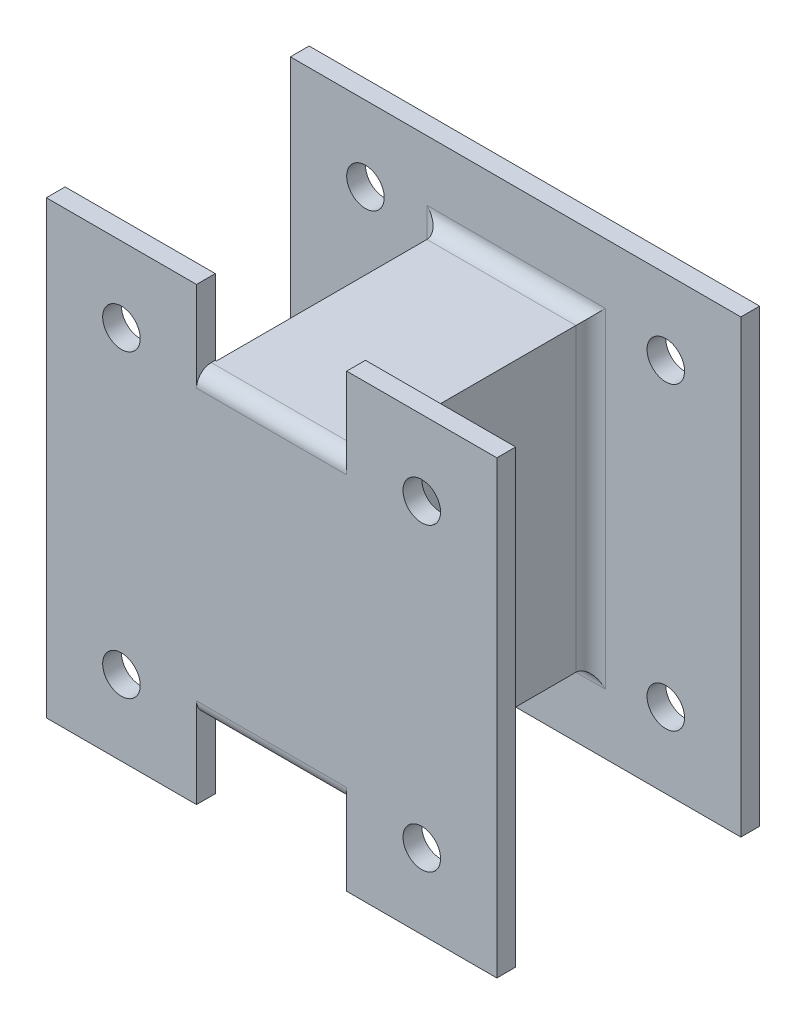
ISO-10303-21;
HEADER;
FILE_DESCRIPTION(('STEP AP214'),'2;1');
FILE_NAME('part.step','',(''),(''),'','','');
FILE_SCHEMA(('AUTOMOTIVE_DESIGN { 1 0 10303 214 1 1 1 1 }'));
ENDSEC;
DATA;
#1=APPLICATION_CONTEXT('core data for automotive mechanical design processes');
#2=APPLICATION_PROTOCOL_DEFINITION('international standard','automotive_design',2000,#1);
#3=PRODUCT_CONTEXT('',#1,'mechanical');
#4=PRODUCT('Part','Part','',(#3));
#5=PRODUCT_RELATED_PRODUCT_CATEGORY('part','',(#4));
#6=PRODUCT_DEFINITION_FORMATION('','',#4);
#7=PRODUCT_DEFINITION_CONTEXT('part definition',#1,'design');
#8=PRODUCT_DEFINITION('design','',#6,#7);
#9=PRODUCT_DEFINITION_SHAPE('','',#8);
#10=(LENGTH_UNIT() NAMED_UNIT(*) SI_UNIT(.MILLI.,.METRE.));
#11=(NAMED_UNIT(*) PLANE_ANGLE_UNIT() SI_UNIT($,.RADIAN.));
#12=(NAMED_UNIT(*) SI_UNIT($,.STERADIAN.) SOLID_ANGLE_UNIT());
#13=UNCERTAINTY_MEASURE_WITH_UNIT(LENGTH_MEASURE(1.E-05),#10,'distance_accuracy_value','');
#14=(GEOMETRIC_REPRESENTATION_CONTEXT(3) GLOBAL_UNCERTAINTY_ASSIGNED_CONTEXT((#13)) GLOBAL_UNIT_ASSIGNED_CONTEXT((#10,
#11,#12)) REPRESENTATION_CONTEXT('',''));
#15=CARTESIAN_POINT('',(0.,0.,0.));
#16=DIRECTION('',(0.,0.,1.));
#17=DIRECTION('',(1.,0.,0.));
#18=AXIS2_PLACEMENT_3D('',#15,#16,#17);
#19=CARTESIAN_POINT('',(0.,0.,6.35));
#20=DIRECTION('',(0.,0.,-1.));
#21=DIRECTION('',(-1.,0.,0.));
#22=AXIS2_PLACEMENT_3D('',#19,#20,#21);
#23=PLANE('',#22);
#24=DIRECTION('',(1.,0.,0.));
#25=VECTOR('',#24,1.);
#26=CARTESIAN_POINT('',(51.2,20.4,6.35));
#27=LINE('',#26,#25);
#28=CARTESIAN_POINT('',(106.6,20.4,6.35));
#29=VERTEX_POINT('',#28);
#30=CARTESIAN_POINT('',(46.2,20.4,6.35));
#31=VERTEX_POINT('',#30);
#32=EDGE_CURVE('E340',#29,#31,#27,.F.);
#33=ORIENTED_EDGE('',*,*,#32,.T.);
#34=DIRECTION('',(0.,-1.,0.));
#35=VECTOR('',#34,1.);
#36=CARTESIAN_POINT('',(46.2,127.,6.35));
#37=LINE('',#36,#35);
#38=CARTESIAN_POINT('',(46.2,132.,6.35));
#39=VERTEX_POINT('',#38);
#40=EDGE_CURVE('E343',#31,#39,#37,.F.);
#41=ORIENTED_EDGE('',*,*,#40,.T.);
#42=DIRECTION('',(1.,0.,0.));
#43=VECTOR('',#42,1.);
#44=CARTESIAN_POINT('',(0.,132.,6.35));
#45=LINE('',#44,#43);
#46=CARTESIAN_POINT('',(106.6,132.,6.35));
#47=VERTEX_POINT('',#46);
#48=EDGE_CURVE('E334',#39,#47,#45,.T.);
#49=ORIENTED_EDGE('',*,*,#48,.T.);
#50=DIRECTION('',(0.,-1.,0.));
#51=VECTOR('',#50,1.);
#52=CARTESIAN_POINT('',(106.6,0.,6.35));
#53=LINE('',#52,#51);
#54=EDGE_CURVE('E337',#47,#29,#53,.T.);
#55=ORIENTED_EDGE('',*,*,#54,.T.);
#56=EDGE_LOOP('',(#33,#41,#49,#55));
#57=FACE_BOUND('',#56,.T.);
#58=CARTESIAN_POINT('',(25.4000000000011,25.4,6.35));
#59=DIRECTION('',(0.,0.,1.));
#60=DIRECTION('',(1.,0.,0.));
#61=AXIS2_PLACEMENT_3D('',#58,#59,#60);
#62=CIRCLE('',#61,6.35);
#63=CARTESIAN_POINT('',(31.7500000000011,25.4,6.35));
#64=VERTEX_POINT('',#63);
#65=EDGE_CURVE('E257',#64,#64,#62,.T.);
#66=ORIENTED_EDGE('',*,*,#65,.F.);
#67=EDGE_LOOP('',(#66));
#68=FACE_BOUND('',#67,.T.);
#69=CARTESIAN_POINT('',(127.000000000001,25.4000000000014,6.35));
#70=DIRECTION('',(0.,0.,1.));
#71=DIRECTION('',(1.,0.,0.));
#72=AXIS2_PLACEMENT_3D('',#69,#70,#71);
#73=CIRCLE('',#72,6.34999999999999);
#74=CARTESIAN_POINT('',(133.350000000001,25.4000000000014,6.35));
#75=VERTEX_POINT('',#74);
#76=EDGE_CURVE('E265',#75,#75,#73,.T.);
#77=ORIENTED_EDGE('',*,*,#76,.F.);
#78=EDGE_LOOP('',(#77));
#79=FACE_BOUND('',#78,.T.);
#80=CARTESIAN_POINT('',(127.,127.000000000001,6.35));
#81=DIRECTION('',(0.,0.,1.));
#82=DIRECTION('',(1.,0.,0.));
#83=AXIS2_PLACEMENT_3D('',#80,#81,#82);
#84=CIRCLE('',#83,6.34999999999999);
#85=CARTESIAN_POINT('',(133.35,127.000000000001,6.35));
#86=VERTEX_POINT('',#85);
#87=EDGE_CURVE('E273',#86,#86,#84,.T.);
#88=ORIENTED_EDGE('',*,*,#87,.F.);
#89=EDGE_LOOP('',(#88));
#90=FACE_BOUND('',#89,.T.);
#91=CARTESIAN_POINT('',(25.4,127.,6.35));
#92=DIRECTION('',(0.,0.,1.));
#93=DIRECTION('',(1.,0.,0.));
#94=AXIS2_PLACEMENT_3D('',#91,#92,#93);
#95=CIRCLE('',#94,6.35);
#96=CARTESIAN_POINT('',(31.75,127.,6.35));
#97=VERTEX_POINT('',#96);
#98=EDGE_CURVE('E281',#97,#97,#95,.T.);
#99=ORIENTED_EDGE('',*,*,#98,.F.);
#100=EDGE_LOOP('',(#99));
#101=FACE_BOUND('',#100,.T.);
#102=DIRECTION('',(0.,-1.,0.));
#103=VECTOR('',#102,1.);
#104=CARTESIAN_POINT('',(0.,0.,6.35));
#105=LINE('',#104,#103);
#106=CARTESIAN_POINT('',(0.,152.4,6.35));
#107=VERTEX_POINT('',#106);
#108=CARTESIAN_POINT('',(0.,0.,6.35));
#109=VERTEX_POINT('',#108);
#110=EDGE_CURVE('E289',#107,#109,#105,.T.);
#111=ORIENTED_EDGE('',*,*,#110,.T.);
#112=DIRECTION('',(1.,0.,0.));
#113=VECTOR('',#112,1.);
#114=CARTESIAN_POINT('',(0.,0.,6.35));
#115=LINE('',#114,#113);
#116=CARTESIAN_POINT('',(152.4,0.,6.35));
#117=VERTEX_POINT('',#116);
#118=EDGE_CURVE('E293',#109,#117,#115,.T.);
#119=ORIENTED_EDGE('',*,*,#118,.T.);
#120=DIRECTION('',(0.,1.,0.));
#121=VECTOR('',#120,1.);
#122=CARTESIAN_POINT('',(152.4,0.,6.35));
#123=LINE('',#122,#121);
#124=CARTESIAN_POINT('',(152.4,152.4,6.35));
#125=VERTEX_POINT('',#124);
#126=EDGE_CURVE('E297',#117,#125,#123,.T.);
#127=ORIENTED_EDGE('',*,*,#126,.T.);
#128=DIRECTION('',(-1.,0.,0.));
#129=VECTOR('',#128,1.);
#130=CARTESIAN_POINT('',(0.,152.4,6.35));
#131=LINE('',#130,#129);
#132=EDGE_CURVE('E300',#125,#107,#131,.T.);
#133=ORIENTED_EDGE('',*,*,#132,.T.);
#134=EDGE_LOOP('',(#111,#119,#127,#133));
#135=FACE_BOUND('',#134,.T.);
#136=ADVANCED_FACE('F41',(#57,#68,#79,#90,#101,#135),#23,.F.);
#137=CARTESIAN_POINT('',(0.,0.,0.));
#138=DIRECTION('',(0.,0.,-1.));
#139=DIRECTION('',(-1.,0.,0.));
#140=AXIS2_PLACEMENT_3D('',#137,#138,#139);
#141=PLANE('',#140);
#142=CARTESIAN_POINT('',(127.000000000001,25.4000000000014,0.));
#143=DIRECTION('',(0.,0.,1.));
#144=DIRECTION('',(1.,0.,0.));
#145=AXIS2_PLACEMENT_3D('',#142,#143,#144);
#146=CIRCLE('',#145,6.34999999999999);
#147=CARTESIAN_POINT('',(133.350000000001,25.4000000000014,0.));
#148=VERTEX_POINT('',#147);
#149=EDGE_CURVE('E261',#148,#148,#146,.T.);
#150=ORIENTED_EDGE('',*,*,#149,.T.);
#151=EDGE_LOOP('',(#150));
#152=FACE_BOUND('',#151,.T.);
#153=CARTESIAN_POINT('',(25.4,127.,0.));
#154=DIRECTION('',(0.,0.,1.));
#155=DIRECTION('',(1.,0.,0.));
#156=AXIS2_PLACEMENT_3D('',#153,#154,#155);
#157=CIRCLE('',#156,6.35);
#158=CARTESIAN_POINT('',(31.75,127.,0.));
#159=VERTEX_POINT('',#158);
#160=EDGE_CURVE('E277',#159,#159,#157,.T.);
#161=ORIENTED_EDGE('',*,*,#160,.T.);
#162=EDGE_LOOP('',(#161));
#163=FACE_BOUND('',#162,.T.);
#164=DIRECTION('',(0.,-1.,0.));
#165=VECTOR('',#164,1.);
#166=CARTESIAN_POINT('',(0.,0.,0.));
#167=LINE('',#166,#165);
#168=CARTESIAN_POINT('',(0.,152.4,0.));
#169=VERTEX_POINT('',#168);
#170=CARTESIAN_POINT('',(0.,0.,0.));
#171=VERTEX_POINT('',#170);
#172=EDGE_CURVE('E285',#169,#171,#167,.T.);
#173=ORIENTED_EDGE('',*,*,#172,.F.);
#174=DIRECTION('',(-1.,0.,0.));
#175=VECTOR('',#174,1.);
#176=CARTESIAN_POINT('',(0.,152.4,0.));
#177=LINE('',#176,#175);
#178=CARTESIAN_POINT('',(152.4,152.4,0.));
#179=VERTEX_POINT('',#178);
#180=EDGE_CURVE('E294',#179,#169,#177,.T.);
#181=ORIENTED_EDGE('',*,*,#180,.F.);
#182=DIRECTION('',(0.,1.,0.));
#183=VECTOR('',#182,1.);
#184=CARTESIAN_POINT('',(152.4,0.,0.));
#185=LINE('',#184,#183);
#186=CARTESIAN_POINT('',(152.4,0.,0.));
#187=VERTEX_POINT('',#186);
#188=EDGE_CURVE('E310',#187,#179,#185,.T.);
#189=ORIENTED_EDGE('',*,*,#188,.F.);
#190=DIRECTION('',(1.,0.,0.));
#191=VECTOR('',#190,1.);
#192=CARTESIAN_POINT('',(0.,0.,0.));
#193=LINE('',#192,#191);
#194=EDGE_CURVE('E307',#171,#187,#193,.T.);
#195=ORIENTED_EDGE('',*,*,#194,.F.);
#196=EDGE_LOOP('',(#173,#181,#189,#195));
#197=FACE_BOUND('',#196,.T.);
#198=CARTESIAN_POINT('',(127.,127.000000000001,0.));
#199=DIRECTION('',(0.,0.,1.));
#200=DIRECTION('',(1.,0.,0.));
#201=AXIS2_PLACEMENT_3D('',#198,#199,#200);
#202=CIRCLE('',#201,6.34999999999999);
#203=CARTESIAN_POINT('',(133.35,127.000000000001,0.));
#204=VERTEX_POINT('',#203);
#205=EDGE_CURVE('E269',#204,#204,#202,.T.);
#206=ORIENTED_EDGE('',*,*,#205,.T.);
#207=EDGE_LOOP('',(#206));
#208=FACE_BOUND('',#207,.T.);
#209=CARTESIAN_POINT('',(25.4000000000011,25.4,0.));
#210=DIRECTION('',(0.,0.,1.));
#211=DIRECTION('',(1.,0.,0.));
#212=AXIS2_PLACEMENT_3D('',#209,#210,#211);
#213=CIRCLE('',#212,6.35);
#214=CARTESIAN_POINT('',(31.7500000000011,25.4,0.));
#215=VERTEX_POINT('',#214);
#216=EDGE_CURVE('E256',#215,#215,#213,.T.);
#217=ORIENTED_EDGE('',*,*,#216,.T.);
#218=EDGE_LOOP('',(#217));
#219=FACE_BOUND('',#218,.T.);
#220=ADVANCED_FACE('F569',(#152,#163,#197,#208,#219),#141,.T.);
#221=CARTESIAN_POINT('',(0.,0.,6.35));
#222=DIRECTION('',(1.,0.,0.));
#223=DIRECTION('',(0.,0.,-1.));
#224=AXIS2_PLACEMENT_3D('',#221,#222,#223);
#225=PLANE('',#224);
#226=ORIENTED_EDGE('',*,*,#172,.T.);
#227=DIRECTION('',(0.,0.,-1.));
#228=VECTOR('',#227,1.);
#229=CARTESIAN_POINT('',(0.,0.,6.35));
#230=LINE('',#229,#228);
#231=EDGE_CURVE('E326',#109,#171,#230,.T.);
#232=ORIENTED_EDGE('',*,*,#231,.F.);
#233=ORIENTED_EDGE('',*,*,#110,.F.);
#234=DIRECTION('',(0.,0.,-1.));
#235=VECTOR('',#234,1.);
#236=CARTESIAN_POINT('',(0.,152.4,6.35));
#237=LINE('',#236,#235);
#238=EDGE_CURVE('E303',#107,#169,#237,.T.);
#239=ORIENTED_EDGE('',*,*,#238,.T.);
#240=EDGE_LOOP('',(#226,#232,#233,#239));
#241=FACE_BOUND('',#240,.T.);
#242=ADVANCED_FACE('F574',(#241),#225,.F.);
#243=CARTESIAN_POINT('',(0.,0.,6.35));
#244=DIRECTION('',(0.,1.,0.));
#245=DIRECTION('',(0.,0.,1.));
#246=AXIS2_PLACEMENT_3D('',#243,#244,#245);
#247=PLANE('',#246);
#248=ORIENTED_EDGE('',*,*,#194,.T.);
#249=DIRECTION('',(0.,0.,-1.));
#250=VECTOR('',#249,1.);
#251=CARTESIAN_POINT('',(152.4,0.,6.35));
#252=LINE('',#251,#250);
#253=EDGE_CURVE('E322',#117,#187,#252,.T.);
#254=ORIENTED_EDGE('',*,*,#253,.F.);
#255=ORIENTED_EDGE('',*,*,#118,.F.);
#256=ORIENTED_EDGE('',*,*,#231,.T.);
#257=EDGE_LOOP('',(#248,#254,#255,#256));
#258=FACE_BOUND('',#257,.T.);
#259=ADVANCED_FACE('F588',(#258),#247,.F.);
#260=CARTESIAN_POINT('',(152.4,0.,6.35));
#261=DIRECTION('',(-1.,0.,0.));
#262=DIRECTION('',(0.,0.,1.));
#263=AXIS2_PLACEMENT_3D('',#260,#261,#262);
#264=PLANE('',#263);
#265=ORIENTED_EDGE('',*,*,#188,.T.);
#266=DIRECTION('',(0.,0.,-1.));
#267=VECTOR('',#266,1.);
#268=CARTESIAN_POINT('',(152.4,152.4,6.35));
#269=LINE('',#268,#267);
#270=EDGE_CURVE('E318',#125,#179,#269,.T.);
#271=ORIENTED_EDGE('',*,*,#270,.F.);
#272=ORIENTED_EDGE('',*,*,#126,.F.);
#273=ORIENTED_EDGE('',*,*,#253,.T.);
#274=EDGE_LOOP('',(#265,#271,#272,#273));
#275=FACE_BOUND('',#274,.T.);
#276=ADVANCED_FACE('F584',(#275),#264,.F.);
#277=CARTESIAN_POINT('',(0.,152.4,6.35));
#278=DIRECTION('',(0.,-1.,0.));
#279=DIRECTION('',(0.,0.,-1.));
#280=AXIS2_PLACEMENT_3D('',#277,#278,#279);
#281=PLANE('',#280);
#282=ORIENTED_EDGE('',*,*,#180,.T.);
#283=ORIENTED_EDGE('',*,*,#238,.F.);
#284=ORIENTED_EDGE('',*,*,#132,.F.);
#285=ORIENTED_EDGE('',*,*,#270,.T.);
#286=EDGE_LOOP('',(#282,#283,#284,#285));
#287=FACE_BOUND('',#286,.T.);
#288=ADVANCED_FACE('F581',(#287),#281,.F.);
#289=CARTESIAN_POINT('',(25.4,127.,6.35));
#290=DIRECTION('',(0.,0.,-1.));
#291=DIRECTION('',(-1.,0.,0.));
#292=AXIS2_PLACEMENT_3D('',#289,#290,#291);
#293=CYLINDRICAL_SURFACE('',#292,6.35);
#294=ORIENTED_EDGE('',*,*,#98,.T.);
#295=EDGE_LOOP('',(#294));
#296=FACE_BOUND('',#295,.T.);
#297=ORIENTED_EDGE('',*,*,#160,.F.);
#298=EDGE_LOOP('',(#297));
#299=FACE_BOUND('',#298,.T.);
#300=ADVANCED_FACE('F578',(#296,#299),#293,.F.);
#301=CARTESIAN_POINT('',(127.,127.000000000001,6.35));
#302=DIRECTION('',(0.,0.,-1.));
#303=DIRECTION('',(-1.,0.,0.));
#304=AXIS2_PLACEMENT_3D('',#301,#302,#303);
#305=CYLINDRICAL_SURFACE('',#304,6.34999999999999);
#306=ORIENTED_EDGE('',*,*,#87,.T.);
#307=EDGE_LOOP('',(#306));
#308=FACE_BOUND('',#307,.T.);
#309=ORIENTED_EDGE('',*,*,#205,.F.);
#310=EDGE_LOOP('',(#309));
#311=FACE_BOUND('',#310,.T.);
#312=ADVANCED_FACE('F801',(#308,#311),#305,.F.);
#313=CARTESIAN_POINT('',(127.000000000001,25.4000000000014,6.35));
#314=DIRECTION('',(0.,0.,-1.));
#315=DIRECTION('',(-1.,0.,0.));
#316=AXIS2_PLACEMENT_3D('',#313,#314,#315);
#317=CYLINDRICAL_SURFACE('',#316,6.34999999999999);
#318=ORIENTED_EDGE('',*,*,#76,.T.);
#319=EDGE_LOOP('',(#318));
#320=FACE_BOUND('',#319,.T.);
#321=ORIENTED_EDGE('',*,*,#149,.F.);
#322=EDGE_LOOP('',(#321));
#323=FACE_BOUND('',#322,.T.);
#324=ADVANCED_FACE('F798',(#320,#323),#317,.F.);
#325=CARTESIAN_POINT('',(25.4000000000011,25.4,6.35));
#326=DIRECTION('',(0.,0.,-1.));
#327=DIRECTION('',(-1.,0.,0.));
#328=AXIS2_PLACEMENT_3D('',#325,#326,#327);
#329=CYLINDRICAL_SURFACE('',#328,6.35);
#330=ORIENTED_EDGE('',*,*,#65,.T.);
#331=EDGE_LOOP('',(#330));
#332=FACE_BOUND('',#331,.T.);
#333=ORIENTED_EDGE('',*,*,#216,.F.);
#334=EDGE_LOOP('',(#333));
#335=FACE_BOUND('',#334,.T.);
#336=ADVANCED_FACE('F795',(#332,#335),#329,.F.);
#337=CARTESIAN_POINT('',(51.2,25.4,82.55));
#338=DIRECTION('',(0.,1.,0.));
#339=DIRECTION('',(-1.,0.,0.));
#340=AXIS2_PLACEMENT_3D('',#337,#338,#339);
#341=PLANE('',#340);
#342=DIRECTION('',(0.,0.,-1.));
#343=VECTOR('',#342,1.);
#344=CARTESIAN_POINT('',(101.6,25.4000000000001,88.9));
#345=LINE('',#344,#343);
#346=CARTESIAN_POINT('',(101.6,25.4000000000001,83.9));
#347=VERTEX_POINT('',#346);
#348=CARTESIAN_POINT('',(101.6,25.4,82.55));
#349=VERTEX_POINT('',#348);
#350=EDGE_CURVE('E491',#347,#349,#345,.T.);
#351=ORIENTED_EDGE('',*,*,#350,.F.);
#352=DIRECTION('',(1.,0.,0.));
#353=VECTOR('',#352,1.);
#354=CARTESIAN_POINT('',(50.8,25.4,83.9));
#355=LINE('',#354,#353);
#356=CARTESIAN_POINT('',(50.8,25.4000000000001,83.9));
#357=VERTEX_POINT('',#356);
#358=EDGE_CURVE('E378',#347,#357,#355,.F.);
#359=ORIENTED_EDGE('',*,*,#358,.T.);
#360=DIRECTION('',(0.,0.,-1.));
#361=VECTOR('',#360,1.);
#362=CARTESIAN_POINT('',(50.8,25.4000000000001,88.9));
#363=LINE('',#362,#361);
#364=CARTESIAN_POINT('',(50.8,25.4000000000001,82.55));
#365=VERTEX_POINT('',#364);
#366=EDGE_CURVE('E233',#357,#365,#363,.T.);
#367=ORIENTED_EDGE('',*,*,#366,.T.);
#368=DIRECTION('',(1.,0.,0.));
#369=VECTOR('',#368,1.);
#370=CARTESIAN_POINT('',(50.8,25.4000000000001,82.55));
#371=LINE('',#370,#369);
#372=CARTESIAN_POINT('',(51.2,25.4000000000001,82.55));
#373=VERTEX_POINT('',#372);
#374=EDGE_CURVE('E434',#365,#373,#371,.T.);
#375=ORIENTED_EDGE('',*,*,#374,.T.);
#376=DIRECTION('',(0.,0.,-1.));
#377=VECTOR('',#376,1.);
#378=CARTESIAN_POINT('',(51.2,25.4,82.55));
#379=LINE('',#378,#377);
#380=CARTESIAN_POINT('',(51.2,25.4,11.35));
#381=VERTEX_POINT('',#380);
#382=EDGE_CURVE('E240',#373,#381,#379,.T.);
#383=ORIENTED_EDGE('',*,*,#382,.T.);
#384=DIRECTION('',(1.,0.,0.));
#385=VECTOR('',#384,1.);
#386=CARTESIAN_POINT('',(101.6,25.4,11.35));
#387=LINE('',#386,#385);
#388=CARTESIAN_POINT('',(101.6,25.4,11.35));
#389=VERTEX_POINT('',#388);
#390=EDGE_CURVE('E347',#381,#389,#387,.T.);
#391=ORIENTED_EDGE('',*,*,#390,.T.);
#392=DIRECTION('',(0.,0.,-1.));
#393=VECTOR('',#392,1.);
#394=CARTESIAN_POINT('',(101.6,25.4,82.55));
#395=LINE('',#394,#393);
#396=EDGE_CURVE('E252',#349,#389,#395,.T.);
#397=ORIENTED_EDGE('',*,*,#396,.F.);
#398=EDGE_LOOP('',(#351,#359,#367,#375,#383,#391,#397));
#399=FACE_BOUND('',#398,.T.);
#400=ADVANCED_FACE('F496',(#399),#341,.F.);
#401=CARTESIAN_POINT('',(101.6,127.,82.55));
#402=DIRECTION('',(1.,0.,0.));
#403=DIRECTION('',(0.,1.,0.));
#404=AXIS2_PLACEMENT_3D('',#401,#402,#403);
#405=PLANE('',#404);
#406=ORIENTED_EDGE('',*,*,#396,.T.);
#407=DIRECTION('',(0.,-1.,0.));
#408=VECTOR('',#407,1.);
#409=CARTESIAN_POINT('',(101.6,127.,11.35));
#410=LINE('',#409,#408);
#411=CARTESIAN_POINT('',(101.6,127.,11.35));
#412=VERTEX_POINT('',#411);
#413=EDGE_CURVE('E350',#389,#412,#410,.F.);
#414=ORIENTED_EDGE('',*,*,#413,.T.);
#415=DIRECTION('',(0.,0.,-1.));
#416=VECTOR('',#415,1.);
#417=CARTESIAN_POINT('',(101.6,127.,82.55));
#418=LINE('',#417,#416);
#419=CARTESIAN_POINT('',(101.6,127.,82.55));
#420=VERTEX_POINT('',#419);
#421=EDGE_CURVE('E248',#420,#412,#418,.T.);
#422=ORIENTED_EDGE('',*,*,#421,.F.);
#423=DIRECTION('',(0.,-1.,0.));
#424=VECTOR('',#423,1.);
#425=CARTESIAN_POINT('',(101.6,127.,82.55));
#426=LINE('',#425,#424);
#427=EDGE_CURVE('E226',#420,#349,#426,.T.);
#428=ORIENTED_EDGE('',*,*,#427,.T.);
#429=EDGE_LOOP('',(#406,#414,#422,#428));
#430=FACE_BOUND('',#429,.T.);
#431=ADVANCED_FACE('F514',(#430),#405,.T.);
#432=CARTESIAN_POINT('',(51.2,127.,82.55));
#433=DIRECTION('',(0.,1.,0.));
#434=DIRECTION('',(0.,0.,1.));
#435=AXIS2_PLACEMENT_3D('',#432,#433,#434);
#436=PLANE('',#435);
#437=DIRECTION('',(0.,0.,-1.));
#438=VECTOR('',#437,1.);
#439=CARTESIAN_POINT('',(50.8,127.,88.9));
#440=LINE('',#439,#438);
#441=CARTESIAN_POINT('',(50.8,127.,83.9));
#442=VERTEX_POINT('',#441);
#443=CARTESIAN_POINT('',(50.8,127.,82.55));
#444=VERTEX_POINT('',#443);
#445=EDGE_CURVE('E469',#442,#444,#440,.T.);
#446=ORIENTED_EDGE('',*,*,#445,.F.);
#447=DIRECTION('',(-1.,0.,0.));
#448=VECTOR('',#447,1.);
#449=CARTESIAN_POINT('',(51.2,127.,83.9));
#450=LINE('',#449,#448);
#451=CARTESIAN_POINT('',(101.6,127.,83.9));
#452=VERTEX_POINT('',#451);
#453=EDGE_CURVE('E57',#442,#452,#450,.F.);
#454=ORIENTED_EDGE('',*,*,#453,.T.);
#455=DIRECTION('',(0.,0.,-1.));
#456=VECTOR('',#455,1.);
#457=CARTESIAN_POINT('',(101.6,127.,88.9));
#458=LINE('',#457,#456);
#459=EDGE_CURVE('E472',#452,#420,#458,.T.);
#460=ORIENTED_EDGE('',*,*,#459,.T.);
#461=ORIENTED_EDGE('',*,*,#421,.T.);
#462=DIRECTION('',(1.,0.,0.));
#463=VECTOR('',#462,1.);
#464=CARTESIAN_POINT('',(51.2,127.,11.35));
#465=LINE('',#464,#463);
#466=CARTESIAN_POINT('',(51.2,127.,11.35));
#467=VERTEX_POINT('',#466);
#468=EDGE_CURVE('E353',#412,#467,#465,.F.);
#469=ORIENTED_EDGE('',*,*,#468,.T.);
#470=DIRECTION('',(0.,0.,-1.));
#471=VECTOR('',#470,1.);
#472=CARTESIAN_POINT('',(51.2,127.,82.55));
#473=LINE('',#472,#471);
#474=CARTESIAN_POINT('',(51.2,127.,82.55));
#475=VERTEX_POINT('',#474);
#476=EDGE_CURVE('E244',#475,#467,#473,.T.);
#477=ORIENTED_EDGE('',*,*,#476,.F.);
#478=DIRECTION('',(-1.,0.,0.));
#479=VECTOR('',#478,1.);
#480=CARTESIAN_POINT('',(50.8,127.,82.55));
#481=LINE('',#480,#479);
#482=EDGE_CURVE('E454',#475,#444,#481,.T.);
#483=ORIENTED_EDGE('',*,*,#482,.T.);
#484=EDGE_LOOP('',(#446,#454,#460,#461,#469,#477,#483));
#485=FACE_BOUND('',#484,.T.);
#486=ADVANCED_FACE('F534',(#485),#436,.T.);
#487=CARTESIAN_POINT('',(51.2,127.,82.55));
#488=DIRECTION('',(1.,0.,0.));
#489=DIRECTION('',(0.,1.,0.));
#490=AXIS2_PLACEMENT_3D('',#487,#488,#489);
#491=PLANE('',#490);
#492=ORIENTED_EDGE('',*,*,#476,.T.);
#493=DIRECTION('',(0.,-1.,0.));
#494=VECTOR('',#493,1.);
#495=CARTESIAN_POINT('',(51.2,25.4,11.35));
#496=LINE('',#495,#494);
#497=EDGE_CURVE('E330',#467,#381,#496,.T.);
#498=ORIENTED_EDGE('',*,*,#497,.T.);
#499=ORIENTED_EDGE('',*,*,#382,.F.);
#500=DIRECTION('',(0.,-1.,0.));
#501=VECTOR('',#500,1.);
#502=CARTESIAN_POINT('',(51.2,127.,82.55));
#503=LINE('',#502,#501);
#504=EDGE_CURVE('E231',#475,#373,#503,.T.);
#505=ORIENTED_EDGE('',*,*,#504,.F.);
#506=EDGE_LOOP('',(#492,#498,#499,#505));
#507=FACE_BOUND('',#506,.T.);
#508=ADVANCED_FACE('F505',(#507),#491,.F.);
#509=CARTESIAN_POINT('',(0.,0.,82.55));
#510=DIRECTION('',(0.,0.,1.));
#511=DIRECTION('',(1.,0.,0.));
#512=AXIS2_PLACEMENT_3D('',#509,#510,#511);
#513=PLANE('',#512);
#514=CARTESIAN_POINT('',(25.4000000000011,25.4,82.55));
#515=DIRECTION('',(0.,0.,1.));
#516=DIRECTION('',(1.,0.,0.));
#517=AXIS2_PLACEMENT_3D('',#514,#515,#516);
#518=CIRCLE('',#517,6.35);
#519=CARTESIAN_POINT('',(31.7500000000011,25.4,82.55));
#520=VERTEX_POINT('',#519);
#521=EDGE_CURVE('E371',#520,#520,#518,.T.);
#522=ORIENTED_EDGE('',*,*,#521,.T.);
#523=EDGE_LOOP('',(#522));
#524=FACE_BOUND('',#523,.T.);
#525=CARTESIAN_POINT('',(25.4,127.,82.55));
#526=DIRECTION('',(0.,0.,1.));
#527=DIRECTION('',(1.,0.,0.));
#528=AXIS2_PLACEMENT_3D('',#525,#526,#527);
#529=CIRCLE('',#528,6.35);
#530=CARTESIAN_POINT('',(31.75,127.,82.55));
#531=VERTEX_POINT('',#530);
#532=EDGE_CURVE('E744',#531,#531,#529,.T.);
#533=ORIENTED_EDGE('',*,*,#532,.T.);
#534=EDGE_LOOP('',(#533));
#535=FACE_BOUND('',#534,.T.);
#536=ORIENTED_EDGE('',*,*,#482,.F.);
#537=ORIENTED_EDGE('',*,*,#504,.T.);
#538=ORIENTED_EDGE('',*,*,#374,.F.);
#539=DIRECTION('',(0.,1.,0.));
#540=VECTOR('',#539,1.);
#541=CARTESIAN_POINT('',(50.8,0.,82.55));
#542=LINE('',#541,#540);
#543=CARTESIAN_POINT('',(50.8,0.,82.55));
#544=VERTEX_POINT('',#543);
#545=EDGE_CURVE('E431',#544,#365,#542,.T.);
#546=ORIENTED_EDGE('',*,*,#545,.F.);
#547=DIRECTION('',(1.,0.,0.));
#548=VECTOR('',#547,1.);
#549=CARTESIAN_POINT('',(0.,0.,82.55));
#550=LINE('',#549,#548);
#551=CARTESIAN_POINT('',(0.,0.,82.55));
#552=VERTEX_POINT('',#551);
#553=EDGE_CURVE('E427',#552,#544,#550,.T.);
#554=ORIENTED_EDGE('',*,*,#553,.F.);
#555=DIRECTION('',(0.,-1.,0.));
#556=VECTOR('',#555,1.);
#557=CARTESIAN_POINT('',(0.,152.4,82.55));
#558=LINE('',#557,#556);
#559=CARTESIAN_POINT('',(0.,152.4,82.55));
#560=VERTEX_POINT('',#559);
#561=EDGE_CURVE('E224',#560,#552,#558,.T.);
#562=ORIENTED_EDGE('',*,*,#561,.F.);
#563=DIRECTION('',(-1.,0.,0.));
#564=VECTOR('',#563,1.);
#565=CARTESIAN_POINT('',(0.,152.4,82.55));
#566=LINE('',#565,#564);
#567=CARTESIAN_POINT('',(50.8,152.4,82.55));
#568=VERTEX_POINT('',#567);
#569=EDGE_CURVE('E220',#568,#560,#566,.T.);
#570=ORIENTED_EDGE('',*,*,#569,.F.);
#571=DIRECTION('',(0.,1.,0.));
#572=VECTOR('',#571,1.);
#573=CARTESIAN_POINT('',(50.8,152.4,82.55));
#574=LINE('',#573,#572);
#575=EDGE_CURVE('E458',#444,#568,#574,.T.);
#576=ORIENTED_EDGE('',*,*,#575,.F.);
#577=EDGE_LOOP('',(#536,#537,#538,#546,#554,#562,#570,#576));
#578=FACE_BOUND('',#577,.T.);
#579=ADVANCED_FACE('F501',(#524,#535,#578),#513,.F.);
#580=CARTESIAN_POINT('',(0.,0.,88.9));
#581=DIRECTION('',(0.,0.,1.));
#582=DIRECTION('',(1.,0.,0.));
#583=AXIS2_PLACEMENT_3D('',#580,#581,#582);
#584=PLANE('',#583);
#585=CARTESIAN_POINT('',(127.000000000001,25.4,88.9));
#586=DIRECTION('',(0.,0.,1.));
#587=DIRECTION('',(1.,0.,0.));
#588=AXIS2_PLACEMENT_3D('',#585,#586,#587);
#589=CIRCLE('',#588,6.34999999999999);
#590=CARTESIAN_POINT('',(133.350000000001,25.4,88.9));
#591=VERTEX_POINT('',#590);
#592=EDGE_CURVE('E740',#591,#591,#589,.T.);
#593=ORIENTED_EDGE('',*,*,#592,.F.);
#594=EDGE_LOOP('',(#593));
#595=FACE_BOUND('',#594,.T.);
#596=CARTESIAN_POINT('',(25.4,127.,88.9));
#597=DIRECTION('',(0.,0.,1.));
#598=DIRECTION('',(1.,0.,0.));
#599=AXIS2_PLACEMENT_3D('',#596,#597,#598);
#600=CIRCLE('',#599,6.35);
#601=CARTESIAN_POINT('',(31.75,127.,88.9));
#602=VERTEX_POINT('',#601);
#603=EDGE_CURVE('E428',#602,#602,#600,.T.);
#604=ORIENTED_EDGE('',*,*,#603,.F.);
#605=EDGE_LOOP('',(#604));
#606=FACE_BOUND('',#605,.T.);
#607=DIRECTION('',(1.,0.,0.));
#608=VECTOR('',#607,1.);
#609=CARTESIAN_POINT('',(101.6,30.4,88.9));
#610=LINE('',#609,#608);
#611=CARTESIAN_POINT('',(50.8,30.4,88.9));
#612=VERTEX_POINT('',#611);
#613=CARTESIAN_POINT('',(101.6,30.4,88.9));
#614=VERTEX_POINT('',#613);
#615=EDGE_CURVE('E375',#612,#614,#610,.T.);
#616=ORIENTED_EDGE('',*,*,#615,.T.);
#617=DIRECTION('',(0.,-1.,0.));
#618=VECTOR('',#617,1.);
#619=CARTESIAN_POINT('',(101.6,0.,88.9));
#620=LINE('',#619,#618);
#621=CARTESIAN_POINT('',(101.6,0.,88.9));
#622=VERTEX_POINT('',#621);
#623=EDGE_CURVE('E400',#614,#622,#620,.T.);
#624=ORIENTED_EDGE('',*,*,#623,.T.);
#625=DIRECTION('',(1.,0.,0.));
#626=VECTOR('',#625,1.);
#627=CARTESIAN_POINT('',(101.6,0.,88.9));
#628=LINE('',#627,#626);
#629=CARTESIAN_POINT('',(152.4,0.,88.9));
#630=VERTEX_POINT('',#629);
#631=EDGE_CURVE('E405',#622,#630,#628,.T.);
#632=ORIENTED_EDGE('',*,*,#631,.T.);
#633=DIRECTION('',(0.,1.,0.));
#634=VECTOR('',#633,1.);
#635=CARTESIAN_POINT('',(152.4,152.4,88.9));
#636=LINE('',#635,#634);
#637=CARTESIAN_POINT('',(152.4,152.4,88.9));
#638=VERTEX_POINT('',#637);
#639=EDGE_CURVE('E410',#630,#638,#636,.T.);
#640=ORIENTED_EDGE('',*,*,#639,.T.);
#641=DIRECTION('',(-1.,0.,0.));
#642=VECTOR('',#641,1.);
#643=CARTESIAN_POINT('',(101.6,152.4,88.9));
#644=LINE('',#643,#642);
#645=CARTESIAN_POINT('',(101.6,152.4,88.9));
#646=VERTEX_POINT('',#645);
#647=EDGE_CURVE('E413',#638,#646,#644,.T.);
#648=ORIENTED_EDGE('',*,*,#647,.T.);
#649=DIRECTION('',(0.,-1.,0.));
#650=VECTOR('',#649,1.);
#651=CARTESIAN_POINT('',(101.6,152.4,88.9));
#652=LINE('',#651,#650);
#653=CARTESIAN_POINT('',(101.6,122.,88.9));
#654=VERTEX_POINT('',#653);
#655=EDGE_CURVE('E416',#646,#654,#652,.T.);
#656=ORIENTED_EDGE('',*,*,#655,.T.);
#657=DIRECTION('',(-1.,0.,0.));
#658=VECTOR('',#657,1.);
#659=CARTESIAN_POINT('',(0.,122.,88.9));
#660=LINE('',#659,#658);
#661=CARTESIAN_POINT('',(50.8,122.,88.9));
#662=VERTEX_POINT('',#661);
#663=EDGE_CURVE('E356',#654,#662,#660,.T.);
#664=ORIENTED_EDGE('',*,*,#663,.T.);
#665=DIRECTION('',(0.,1.,0.));
#666=VECTOR('',#665,1.);
#667=CARTESIAN_POINT('',(50.8,152.4,88.9));
#668=LINE('',#667,#666);
#669=CARTESIAN_POINT('',(50.8,152.4,88.9));
#670=VERTEX_POINT('',#669);
#671=EDGE_CURVE('E419',#662,#670,#668,.T.);
#672=ORIENTED_EDGE('',*,*,#671,.T.);
#673=DIRECTION('',(-1.,0.,0.));
#674=VECTOR('',#673,1.);
#675=CARTESIAN_POINT('',(0.,152.4,88.9));
#676=LINE('',#675,#674);
#677=CARTESIAN_POINT('',(0.,152.4,88.9));
#678=VERTEX_POINT('',#677);
#679=EDGE_CURVE('E215',#670,#678,#676,.T.);
#680=ORIENTED_EDGE('',*,*,#679,.T.);
#681=DIRECTION('',(0.,-1.,0.));
#682=VECTOR('',#681,1.);
#683=CARTESIAN_POINT('',(0.,152.4,88.9));
#684=LINE('',#683,#682);
#685=CARTESIAN_POINT('',(0.,0.,88.9));
#686=VERTEX_POINT('',#685);
#687=EDGE_CURVE('E208',#678,#686,#684,.T.);
#688=ORIENTED_EDGE('',*,*,#687,.T.);
#689=DIRECTION('',(1.,0.,0.));
#690=VECTOR('',#689,1.);
#691=CARTESIAN_POINT('',(0.,0.,88.9));
#692=LINE('',#691,#690);
#693=CARTESIAN_POINT('',(50.8,0.,88.9));
#694=VERTEX_POINT('',#693);
#695=EDGE_CURVE('E196',#686,#694,#692,.T.);
#696=ORIENTED_EDGE('',*,*,#695,.T.);
#697=DIRECTION('',(0.,1.,0.));
#698=VECTOR('',#697,1.);
#699=CARTESIAN_POINT('',(50.8,0.,88.9));
#700=LINE('',#699,#698);
#701=EDGE_CURVE('E207',#694,#612,#700,.T.);
#702=ORIENTED_EDGE('',*,*,#701,.T.);
#703=EDGE_LOOP('',(#616,#624,#632,#640,#648,#656,#664,#672,#680,#688,#696,#702));
#704=FACE_BOUND('',#703,.T.);
#705=CARTESIAN_POINT('',(127.,127.,88.9));
#706=DIRECTION('',(0.,0.,1.));
#707=DIRECTION('',(1.,0.,0.));
#708=AXIS2_PLACEMENT_3D('',#705,#706,#707);
#709=CIRCLE('',#708,6.34999999999999);
#710=CARTESIAN_POINT('',(133.35,127.,88.9));
#711=VERTEX_POINT('',#710);
#712=EDGE_CURVE('E748',#711,#711,#709,.T.);
#713=ORIENTED_EDGE('',*,*,#712,.F.);
#714=EDGE_LOOP('',(#713));
#715=FACE_BOUND('',#714,.T.);
#716=CARTESIAN_POINT('',(25.4000000000011,25.4,88.9));
#717=DIRECTION('',(0.,0.,1.));
#718=DIRECTION('',(1.,0.,0.));
#719=AXIS2_PLACEMENT_3D('',#716,#717,#718);
#720=CIRCLE('',#719,6.35);
#721=CARTESIAN_POINT('',(31.7500000000011,25.4,88.9));
#722=VERTEX_POINT('',#721);
#723=EDGE_CURVE('E761',#722,#722,#720,.T.);
#724=ORIENTED_EDGE('',*,*,#723,.F.);
#725=EDGE_LOOP('',(#724));
#726=FACE_BOUND('',#725,.T.);
#727=ADVANCED_FACE('F212',(#595,#606,#704,#715,#726),#584,.T.);
#728=ORIENTED_EDGE('',*,*,#427,.F.);
#729=DIRECTION('',(0.,-1.,0.));
#730=VECTOR('',#729,1.);
#731=CARTESIAN_POINT('',(101.6,152.4,82.55));
#732=LINE('',#731,#730);
#733=CARTESIAN_POINT('',(101.6,152.4,82.55));
#734=VERTEX_POINT('',#733);
#735=EDGE_CURVE('E450',#734,#420,#732,.T.);
#736=ORIENTED_EDGE('',*,*,#735,.F.);
#737=DIRECTION('',(-1.,0.,0.));
#738=VECTOR('',#737,1.);
#739=CARTESIAN_POINT('',(101.6,152.4,82.55));
#740=LINE('',#739,#738);
#741=CARTESIAN_POINT('',(152.4,152.4,82.55));
#742=VERTEX_POINT('',#741);
#743=EDGE_CURVE('E447',#742,#734,#740,.T.);
#744=ORIENTED_EDGE('',*,*,#743,.F.);
#745=DIRECTION('',(0.,1.,0.));
#746=VECTOR('',#745,1.);
#747=CARTESIAN_POINT('',(152.4,152.4,82.55));
#748=LINE('',#747,#746);
#749=CARTESIAN_POINT('',(152.4,0.,82.55));
#750=VERTEX_POINT('',#749);
#751=EDGE_CURVE('E444',#750,#742,#748,.T.);
#752=ORIENTED_EDGE('',*,*,#751,.F.);
#753=DIRECTION('',(1.,0.,0.));
#754=VECTOR('',#753,1.);
#755=CARTESIAN_POINT('',(101.6,0.,82.55));
#756=LINE('',#755,#754);
#757=CARTESIAN_POINT('',(101.6,0.,82.55));
#758=VERTEX_POINT('',#757);
#759=EDGE_CURVE('E441',#758,#750,#756,.T.);
#760=ORIENTED_EDGE('',*,*,#759,.F.);
#761=DIRECTION('',(0.,-1.,0.));
#762=VECTOR('',#761,1.);
#763=CARTESIAN_POINT('',(101.6,0.,82.55));
#764=LINE('',#763,#762);
#765=EDGE_CURVE('E438',#349,#758,#764,.T.);
#766=ORIENTED_EDGE('',*,*,#765,.F.);
#767=EDGE_LOOP('',(#728,#736,#744,#752,#760,#766));
#768=FACE_BOUND('',#767,.T.);
#769=CARTESIAN_POINT('',(127.,127.,82.55));
#770=DIRECTION('',(0.,0.,1.));
#771=DIRECTION('',(1.,0.,0.));
#772=AXIS2_PLACEMENT_3D('',#769,#770,#771);
#773=CIRCLE('',#772,6.34999999999999);
#774=CARTESIAN_POINT('',(133.35,127.,82.55));
#775=VERTEX_POINT('',#774);
#776=EDGE_CURVE('E751',#775,#775,#773,.T.);
#777=ORIENTED_EDGE('',*,*,#776,.T.);
#778=EDGE_LOOP('',(#777));
#779=FACE_BOUND('',#778,.T.);
#780=CARTESIAN_POINT('',(127.000000000001,25.4,82.55));
#781=DIRECTION('',(0.,0.,1.));
#782=DIRECTION('',(1.,0.,0.));
#783=AXIS2_PLACEMENT_3D('',#780,#781,#782);
#784=CIRCLE('',#783,6.34999999999999);
#785=CARTESIAN_POINT('',(133.350000000001,25.4,82.55));
#786=VERTEX_POINT('',#785);
#787=EDGE_CURVE('E757',#786,#786,#784,.T.);
#788=ORIENTED_EDGE('',*,*,#787,.T.);
#789=EDGE_LOOP('',(#788));
#790=FACE_BOUND('',#789,.T.);
#791=ADVANCED_FACE('F537',(#768,#779,#790),#513,.F.);
#792=CARTESIAN_POINT('',(0.,152.4,88.9));
#793=DIRECTION('',(1.,0.,0.));
#794=DIRECTION('',(0.,0.,-1.));
#795=AXIS2_PLACEMENT_3D('',#792,#793,#794);
#796=PLANE('',#795);
#797=ORIENTED_EDGE('',*,*,#561,.T.);
#798=DIRECTION('',(0.,0.,-1.));
#799=VECTOR('',#798,1.);
#800=CARTESIAN_POINT('',(0.,0.,88.9));
#801=LINE('',#800,#799);
#802=EDGE_CURVE('E200',#686,#552,#801,.T.);
#803=ORIENTED_EDGE('',*,*,#802,.F.);
#804=ORIENTED_EDGE('',*,*,#687,.F.);
#805=DIRECTION('',(0.,0.,-1.));
#806=VECTOR('',#805,1.);
#807=CARTESIAN_POINT('',(0.,152.4,88.9));
#808=LINE('',#807,#806);
#809=EDGE_CURVE('E424',#678,#560,#808,.T.);
#810=ORIENTED_EDGE('',*,*,#809,.T.);
#811=EDGE_LOOP('',(#797,#803,#804,#810));
#812=FACE_BOUND('',#811,.T.);
#813=ADVANCED_FACE('F222',(#812),#796,.F.);
#814=CARTESIAN_POINT('',(0.,0.,88.9));
#815=DIRECTION('',(0.,1.,0.));
#816=DIRECTION('',(-1.,0.,0.));
#817=AXIS2_PLACEMENT_3D('',#814,#815,#816);
#818=PLANE('',#817);
#819=ORIENTED_EDGE('',*,*,#553,.T.);
#820=DIRECTION('',(0.,0.,-1.));
#821=VECTOR('',#820,1.);
#822=CARTESIAN_POINT('',(50.8,0.,88.9));
#823=LINE('',#822,#821);
#824=EDGE_CURVE('E203',#694,#544,#823,.T.);
#825=ORIENTED_EDGE('',*,*,#824,.F.);
#826=ORIENTED_EDGE('',*,*,#695,.F.);
#827=ORIENTED_EDGE('',*,*,#802,.T.);
#828=EDGE_LOOP('',(#819,#825,#826,#827));
#829=FACE_BOUND('',#828,.T.);
#830=ADVANCED_FACE('F198',(#829),#818,.F.);
#831=CARTESIAN_POINT('',(50.8,0.,88.9));
#832=DIRECTION('',(-1.,0.,0.));
#833=DIRECTION('',(0.,-1.,0.));
#834=AXIS2_PLACEMENT_3D('',#831,#832,#833);
#835=PLANE('',#834);
#836=ORIENTED_EDGE('',*,*,#545,.T.);
#837=ORIENTED_EDGE('',*,*,#366,.F.);
#838=CARTESIAN_POINT('',(50.8,30.4,83.9));
#839=DIRECTION('',(-1.,0.,0.));
#840=DIRECTION('',(0.,-1.,0.));
#841=AXIS2_PLACEMENT_3D('',#838,#839,#840);
#842=CIRCLE('',#841,5.);
#843=EDGE_CURVE('E386',#357,#612,#842,.T.);
#844=ORIENTED_EDGE('',*,*,#843,.T.);
#845=ORIENTED_EDGE('',*,*,#701,.F.);
#846=ORIENTED_EDGE('',*,*,#824,.T.);
#847=EDGE_LOOP('',(#836,#837,#844,#845,#846));
#848=FACE_BOUND('',#847,.T.);
#849=ADVANCED_FACE('F395',(#848),#835,.F.);
#850=CARTESIAN_POINT('',(101.6,0.,88.9));
#851=DIRECTION('',(1.,0.,0.));
#852=DIRECTION('',(0.,0.,-1.));
#853=AXIS2_PLACEMENT_3D('',#850,#851,#852);
#854=PLANE('',#853);
#855=ORIENTED_EDGE('',*,*,#765,.T.);
#856=DIRECTION('',(0.,0.,-1.));
#857=VECTOR('',#856,1.);
#858=CARTESIAN_POINT('',(101.6,0.,88.9));
#859=LINE('',#858,#857);
#860=EDGE_CURVE('E487',#622,#758,#859,.T.);
#861=ORIENTED_EDGE('',*,*,#860,.F.);
#862=ORIENTED_EDGE('',*,*,#623,.F.);
#863=CARTESIAN_POINT('',(101.6,30.4,83.9));
#864=DIRECTION('',(1.,0.,0.));
#865=DIRECTION('',(0.,0.,-1.));
#866=AXIS2_PLACEMENT_3D('',#863,#864,#865);
#867=CIRCLE('',#866,5.);
#868=EDGE_CURVE('E383',#614,#347,#867,.T.);
#869=ORIENTED_EDGE('',*,*,#868,.T.);
#870=ORIENTED_EDGE('',*,*,#350,.T.);
#871=EDGE_LOOP('',(#855,#861,#862,#869,#870));
#872=FACE_BOUND('',#871,.T.);
#873=ADVANCED_FACE('F559',(#872),#854,.F.);
#874=CARTESIAN_POINT('',(101.6,0.,88.9));
#875=DIRECTION('',(0.,1.,0.));
#876=DIRECTION('',(-1.,0.,0.));
#877=AXIS2_PLACEMENT_3D('',#874,#875,#876);
#878=PLANE('',#877);
#879=ORIENTED_EDGE('',*,*,#759,.T.);
#880=DIRECTION('',(0.,0.,-1.));
#881=VECTOR('',#880,1.);
#882=CARTESIAN_POINT('',(152.4,0.,88.9));
#883=LINE('',#882,#881);
#884=EDGE_CURVE('E483',#630,#750,#883,.T.);
#885=ORIENTED_EDGE('',*,*,#884,.F.);
#886=ORIENTED_EDGE('',*,*,#631,.F.);
#887=ORIENTED_EDGE('',*,*,#860,.T.);
#888=EDGE_LOOP('',(#879,#885,#886,#887));
#889=FACE_BOUND('',#888,.T.);
#890=ADVANCED_FACE('F557',(#889),#878,.F.);
#891=CARTESIAN_POINT('',(152.4,152.4,88.9));
#892=DIRECTION('',(-1.,0.,0.));
#893=DIRECTION('',(0.,0.,1.));
#894=AXIS2_PLACEMENT_3D('',#891,#892,#893);
#895=PLANE('',#894);
#896=ORIENTED_EDGE('',*,*,#751,.T.);
#897=DIRECTION('',(0.,0.,-1.));
#898=VECTOR('',#897,1.);
#899=CARTESIAN_POINT('',(152.4,152.4,88.9));
#900=LINE('',#899,#898);
#901=EDGE_CURVE('E479',#638,#742,#900,.T.);
#902=ORIENTED_EDGE('',*,*,#901,.F.);
#903=ORIENTED_EDGE('',*,*,#639,.F.);
#904=ORIENTED_EDGE('',*,*,#884,.T.);
#905=EDGE_LOOP('',(#896,#902,#903,#904));
#906=FACE_BOUND('',#905,.T.);
#907=ADVANCED_FACE('F552',(#906),#895,.F.);
#908=CARTESIAN_POINT('',(101.6,152.4,88.9));
#909=DIRECTION('',(0.,-1.,0.));
#910=DIRECTION('',(0.,0.,-1.));
#911=AXIS2_PLACEMENT_3D('',#908,#909,#910);
#912=PLANE('',#911);
#913=ORIENTED_EDGE('',*,*,#743,.T.);
#914=DIRECTION('',(0.,0.,-1.));
#915=VECTOR('',#914,1.);
#916=CARTESIAN_POINT('',(101.6,152.4,88.9));
#917=LINE('',#916,#915);
#918=EDGE_CURVE('E475',#646,#734,#917,.T.);
#919=ORIENTED_EDGE('',*,*,#918,.F.);
#920=ORIENTED_EDGE('',*,*,#647,.F.);
#921=ORIENTED_EDGE('',*,*,#901,.T.);
#922=EDGE_LOOP('',(#913,#919,#920,#921));
#923=FACE_BOUND('',#922,.T.);
#924=ADVANCED_FACE('F548',(#923),#912,.F.);
#925=CARTESIAN_POINT('',(101.6,152.4,88.9));
#926=DIRECTION('',(1.,0.,0.));
#927=DIRECTION('',(0.,0.,-1.));
#928=AXIS2_PLACEMENT_3D('',#925,#926,#927);
#929=PLANE('',#928);
#930=ORIENTED_EDGE('',*,*,#735,.T.);
#931=ORIENTED_EDGE('',*,*,#459,.F.);
#932=CARTESIAN_POINT('',(101.6,122.,83.9));
#933=DIRECTION('',(1.,0.,0.));
#934=DIRECTION('',(0.,0.,-1.));
#935=AXIS2_PLACEMENT_3D('',#932,#933,#934);
#936=CIRCLE('',#935,5.);
#937=EDGE_CURVE('E11',#452,#654,#936,.T.);
#938=ORIENTED_EDGE('',*,*,#937,.T.);
#939=ORIENTED_EDGE('',*,*,#655,.F.);
#940=ORIENTED_EDGE('',*,*,#918,.T.);
#941=EDGE_LOOP('',(#930,#931,#938,#939,#940));
#942=FACE_BOUND('',#941,.T.);
#943=ADVANCED_FACE('F542',(#942),#929,.F.);
#944=CARTESIAN_POINT('',(50.8,152.4,88.9));
#945=DIRECTION('',(-1.,0.,0.));
#946=DIRECTION('',(0.,-1.,0.));
#947=AXIS2_PLACEMENT_3D('',#944,#945,#946);
#948=PLANE('',#947);
#949=ORIENTED_EDGE('',*,*,#575,.T.);
#950=DIRECTION('',(0.,0.,-1.));
#951=VECTOR('',#950,1.);
#952=CARTESIAN_POINT('',(50.8,152.4,88.9));
#953=LINE('',#952,#951);
#954=EDGE_CURVE('E465',#670,#568,#953,.T.);
#955=ORIENTED_EDGE('',*,*,#954,.F.);
#956=ORIENTED_EDGE('',*,*,#671,.F.);
#957=CARTESIAN_POINT('',(50.8,122.,83.9));
#958=DIRECTION('',(-1.,0.,0.));
#959=DIRECTION('',(0.,-1.,0.));
#960=AXIS2_PLACEMENT_3D('',#957,#958,#959);
#961=CIRCLE('',#960,5.);
#962=EDGE_CURVE('E50',#662,#442,#961,.T.);
#963=ORIENTED_EDGE('',*,*,#962,.T.);
#964=ORIENTED_EDGE('',*,*,#445,.T.);
#965=EDGE_LOOP('',(#949,#955,#956,#963,#964));
#966=FACE_BOUND('',#965,.T.);
#967=ADVANCED_FACE('F613',(#966),#948,.F.);
#968=CARTESIAN_POINT('',(0.,152.4,88.9));
#969=DIRECTION('',(0.,-1.,0.));
#970=DIRECTION('',(0.,0.,-1.));
#971=AXIS2_PLACEMENT_3D('',#968,#969,#970);
#972=PLANE('',#971);
#973=ORIENTED_EDGE('',*,*,#569,.T.);
#974=ORIENTED_EDGE('',*,*,#809,.F.);
#975=ORIENTED_EDGE('',*,*,#679,.F.);
#976=ORIENTED_EDGE('',*,*,#954,.T.);
#977=EDGE_LOOP('',(#973,#974,#975,#976));
#978=FACE_BOUND('',#977,.T.);
#979=ADVANCED_FACE('F616',(#978),#972,.F.);
#980=CARTESIAN_POINT('',(25.4,127.,88.9));
#981=DIRECTION('',(0.,0.,-1.));
#982=DIRECTION('',(-1.,0.,0.));
#983=AXIS2_PLACEMENT_3D('',#980,#981,#982);
#984=CYLINDRICAL_SURFACE('',#983,6.35);
#985=ORIENTED_EDGE('',*,*,#603,.T.);
#986=EDGE_LOOP('',(#985));
#987=FACE_BOUND('',#986,.T.);
#988=ORIENTED_EDGE('',*,*,#532,.F.);
#989=EDGE_LOOP('',(#988));
#990=FACE_BOUND('',#989,.T.);
#991=ADVANCED_FACE('F618',(#987,#990),#984,.F.);
#992=CARTESIAN_POINT('',(127.,127.,88.9));
#993=DIRECTION('',(0.,0.,-1.));
#994=DIRECTION('',(-1.,0.,0.));
#995=AXIS2_PLACEMENT_3D('',#992,#993,#994);
#996=CYLINDRICAL_SURFACE('',#995,6.34999999999999);
#997=ORIENTED_EDGE('',*,*,#712,.T.);
#998=EDGE_LOOP('',(#997));
#999=FACE_BOUND('',#998,.T.);
#1000=ORIENTED_EDGE('',*,*,#776,.F.);
#1001=EDGE_LOOP('',(#1000));
#1002=FACE_BOUND('',#1001,.T.);
#1003=ADVANCED_FACE('F624',(#999,#1002),#996,.F.);
#1004=CARTESIAN_POINT('',(127.000000000001,25.4,88.9));
#1005=DIRECTION('',(0.,0.,-1.));
#1006=DIRECTION('',(-1.,0.,0.));
#1007=AXIS2_PLACEMENT_3D('',#1004,#1005,#1006);
#1008=CYLINDRICAL_SURFACE('',#1007,6.34999999999999);
#1009=ORIENTED_EDGE('',*,*,#592,.T.);
#1010=EDGE_LOOP('',(#1009));
#1011=FACE_BOUND('',#1010,.T.);
#1012=ORIENTED_EDGE('',*,*,#787,.F.);
#1013=EDGE_LOOP('',(#1012));
#1014=FACE_BOUND('',#1013,.T.);
#1015=ADVANCED_FACE('F693',(#1011,#1014),#1008,.F.);
#1016=CARTESIAN_POINT('',(25.4000000000011,25.4,88.9));
#1017=DIRECTION('',(0.,0.,-1.));
#1018=DIRECTION('',(-1.,0.,0.));
#1019=AXIS2_PLACEMENT_3D('',#1016,#1017,#1018);
#1020=CYLINDRICAL_SURFACE('',#1019,6.35);
#1021=ORIENTED_EDGE('',*,*,#723,.T.);
#1022=EDGE_LOOP('',(#1021));
#1023=FACE_BOUND('',#1022,.T.);
#1024=ORIENTED_EDGE('',*,*,#521,.F.);
#1025=EDGE_LOOP('',(#1024));
#1026=FACE_BOUND('',#1025,.T.);
#1027=ADVANCED_FACE('F603',(#1023,#1026),#1020,.F.);
#1028=CARTESIAN_POINT('',(106.6,0.,11.35));
#1029=DIRECTION('',(0.,-1.,0.));
#1030=DIRECTION('',(1.,0.,0.));
#1031=AXIS2_PLACEMENT_3D('',#1028,#1029,#1030);
#1032=CYLINDRICAL_SURFACE('',#1031,5.);
#1033=CARTESIAN_POINT('',(106.6,20.4,11.35));
#1034=DIRECTION('',(-0.707106781186547,-0.707106781186547,0.));
#1035=DIRECTION('',(0.707106781186547,-0.707106781186547,0.));
#1036=AXIS2_PLACEMENT_3D('',#1033,#1034,#1035);
#1037=ELLIPSE('',#1036,7.07106781186548,5.);
#1038=EDGE_CURVE('E363',#29,#389,#1037,.F.);
#1039=ORIENTED_EDGE('',*,*,#1038,.F.);
#1040=ORIENTED_EDGE('',*,*,#54,.F.);
#1041=CARTESIAN_POINT('',(106.6,132.,11.35));
#1042=DIRECTION('',(0.707106781186548,-0.707106781186547,0.));
#1043=DIRECTION('',(0.707106781186547,0.707106781186548,0.));
#1044=AXIS2_PLACEMENT_3D('',#1041,#1042,#1043);
#1045=ELLIPSE('',#1044,7.07106781186547,5.);
#1046=EDGE_CURVE('E367',#412,#47,#1045,.T.);
#1047=ORIENTED_EDGE('',*,*,#1046,.F.);
#1048=ORIENTED_EDGE('',*,*,#413,.F.);
#1049=EDGE_LOOP('',(#1039,#1040,#1047,#1048));
#1050=FACE_BOUND('',#1049,.T.);
#1051=ADVANCED_FACE('F521',(#1050),#1032,.F.);
#1052=CARTESIAN_POINT('',(0.,132.,11.35));
#1053=DIRECTION('',(1.,0.,0.));
#1054=DIRECTION('',(0.,0.,-1.));
#1055=AXIS2_PLACEMENT_3D('',#1052,#1053,#1054);
#1056=CYLINDRICAL_SURFACE('',#1055,5.);
#1057=ORIENTED_EDGE('',*,*,#1046,.T.);
#1058=ORIENTED_EDGE('',*,*,#48,.F.);
#1059=CARTESIAN_POINT('',(46.2,132.,11.35));
#1060=DIRECTION('',(0.707106781186547,0.707106781186548,0.));
#1061=DIRECTION('',(0.707106781186548,-0.707106781186547,0.));
#1062=AXIS2_PLACEMENT_3D('',#1059,#1060,#1061);
#1063=ELLIPSE('',#1062,7.07106781186548,5.);
#1064=EDGE_CURVE('E360',#467,#39,#1063,.T.);
#1065=ORIENTED_EDGE('',*,*,#1064,.F.);
#1066=ORIENTED_EDGE('',*,*,#468,.F.);
#1067=EDGE_LOOP('',(#1057,#1058,#1065,#1066));
#1068=FACE_BOUND('',#1067,.T.);
#1069=ADVANCED_FACE('F533',(#1068),#1056,.F.);
#1070=CARTESIAN_POINT('',(51.2,20.4,11.35));
#1071=DIRECTION('',(-1.,0.,0.));
#1072=DIRECTION('',(0.,-1.,0.));
#1073=AXIS2_PLACEMENT_3D('',#1070,#1071,#1072);
#1074=CYLINDRICAL_SURFACE('',#1073,5.);
#1075=ORIENTED_EDGE('',*,*,#1038,.T.);
#1076=ORIENTED_EDGE('',*,*,#390,.F.);
#1077=CARTESIAN_POINT('',(46.2,20.4,11.35));
#1078=DIRECTION('',(-0.707106781186547,0.707106781186547,0.));
#1079=DIRECTION('',(-0.707106781186547,-0.707106781186547,0.));
#1080=AXIS2_PLACEMENT_3D('',#1077,#1078,#1079);
#1081=ELLIPSE('',#1080,7.07106781186547,5.);
#1082=EDGE_CURVE('E357',#31,#381,#1081,.F.);
#1083=ORIENTED_EDGE('',*,*,#1082,.F.);
#1084=ORIENTED_EDGE('',*,*,#32,.F.);
#1085=EDGE_LOOP('',(#1075,#1076,#1083,#1084));
#1086=FACE_BOUND('',#1085,.T.);
#1087=ADVANCED_FACE('F525',(#1086),#1074,.F.);
#1088=CARTESIAN_POINT('',(46.2,127.,11.35));
#1089=DIRECTION('',(0.,1.,0.));
#1090=DIRECTION('',(-1.,0.,0.));
#1091=AXIS2_PLACEMENT_3D('',#1088,#1089,#1090);
#1092=CYLINDRICAL_SURFACE('',#1091,5.);
#1093=ORIENTED_EDGE('',*,*,#1064,.T.);
#1094=ORIENTED_EDGE('',*,*,#40,.F.);
#1095=ORIENTED_EDGE('',*,*,#1082,.T.);
#1096=ORIENTED_EDGE('',*,*,#497,.F.);
#1097=EDGE_LOOP('',(#1093,#1094,#1095,#1096));
#1098=FACE_BOUND('',#1097,.T.);
#1099=ADVANCED_FACE('F530',(#1098),#1092,.F.);
#1100=CARTESIAN_POINT('',(0.,30.4,83.9));
#1101=DIRECTION('',(-1.,0.,0.));
#1102=DIRECTION('',(0.,-1.,0.));
#1103=AXIS2_PLACEMENT_3D('',#1100,#1101,#1102);
#1104=CYLINDRICAL_SURFACE('',#1103,5.);
#1105=ORIENTED_EDGE('',*,*,#843,.F.);
#1106=ORIENTED_EDGE('',*,*,#358,.F.);
#1107=ORIENTED_EDGE('',*,*,#868,.F.);
#1108=ORIENTED_EDGE('',*,*,#615,.F.);
#1109=EDGE_LOOP('',(#1105,#1106,#1107,#1108));
#1110=FACE_BOUND('',#1109,.T.);
#1111=ADVANCED_FACE('F399',(#1110),#1104,.T.);
#1112=CARTESIAN_POINT('',(0.,122.,83.9));
#1113=DIRECTION('',(-1.,0.,0.));
#1114=DIRECTION('',(0.,0.,1.));
#1115=AXIS2_PLACEMENT_3D('',#1112,#1113,#1114);
#1116=CYLINDRICAL_SURFACE('',#1115,5.);
#1117=ORIENTED_EDGE('',*,*,#937,.F.);
#1118=ORIENTED_EDGE('',*,*,#453,.F.);
#1119=ORIENTED_EDGE('',*,*,#962,.F.);
#1120=ORIENTED_EDGE('',*,*,#663,.F.);
#1121=EDGE_LOOP('',(#1117,#1118,#1119,#1120));
#1122=FACE_BOUND('',#1121,.T.);
#1123=ADVANCED_FACE('F43',(#1122),#1116,.T.);
#1124=CLOSED_SHELL('',(#136,#220,#242,#259,#276,#288,#300,#312,#324,#336,#400,#431,#486,#508,
#579,#727,#791,#813,#830,#849,#873,#890,#907,#924,#943,#967,#979,#991,#1003,#1015,#1027,#1051,
#1069,#1087,#1099,#1111,#1123));
#1125=MANIFOLD_SOLID_BREP('B2',#1124);
#1126=ADVANCED_BREP_SHAPE_REPRESENTATION('',(#18,#1125),#14);
#1127=SHAPE_DEFINITION_REPRESENTATION(#9,#1126);
ENDSEC;
END-ISO-10303-21;
